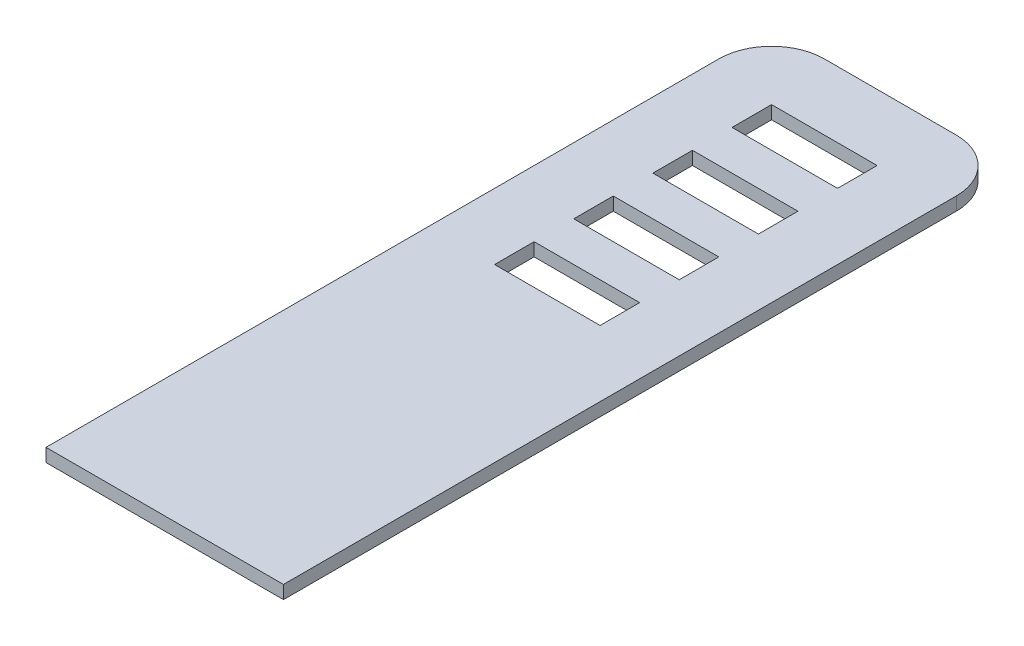
ISO-10303-21;
HEADER;
FILE_DESCRIPTION(('STEP AP214'),'2;1');
FILE_NAME('part.step','',(''),(''),'','','');
FILE_SCHEMA(('AUTOMOTIVE_DESIGN { 1 0 10303 214 1 1 1 1 }'));
ENDSEC;
DATA;
#1=APPLICATION_CONTEXT('core data for automotive mechanical design processes');
#2=APPLICATION_PROTOCOL_DEFINITION('international standard','automotive_design',2000,#1);
#3=PRODUCT_CONTEXT('',#1,'mechanical');
#4=PRODUCT('Part','Part','',(#3));
#5=PRODUCT_RELATED_PRODUCT_CATEGORY('part','',(#4));
#6=PRODUCT_DEFINITION_FORMATION('','',#4);
#7=PRODUCT_DEFINITION_CONTEXT('part definition',#1,'design');
#8=PRODUCT_DEFINITION('design','',#6,#7);
#9=PRODUCT_DEFINITION_SHAPE('','',#8);
#10=(LENGTH_UNIT() NAMED_UNIT(*) SI_UNIT(.MILLI.,.METRE.));
#11=(NAMED_UNIT(*) PLANE_ANGLE_UNIT() SI_UNIT($,.RADIAN.));
#12=(NAMED_UNIT(*) SI_UNIT($,.STERADIAN.) SOLID_ANGLE_UNIT());
#13=UNCERTAINTY_MEASURE_WITH_UNIT(LENGTH_MEASURE(1.E-05),#10,'distance_accuracy_value','');
#14=(GEOMETRIC_REPRESENTATION_CONTEXT(3) GLOBAL_UNCERTAINTY_ASSIGNED_CONTEXT((#13)) GLOBAL_UNIT_ASSIGNED_CONTEXT((#10,
#11,#12)) REPRESENTATION_CONTEXT('',''));
#15=CARTESIAN_POINT('',(0.,0.,0.));
#16=DIRECTION('',(0.,0.,1.));
#17=DIRECTION('',(1.,0.,0.));
#18=AXIS2_PLACEMENT_3D('',#15,#16,#17);
#19=CARTESIAN_POINT('',(0.,0.,0.));
#20=DIRECTION('',(0.,1.,0.));
#21=DIRECTION('',(0.,0.,1.));
#22=AXIS2_PLACEMENT_3D('',#19,#20,#21);
#23=PLANE('',#22);
#24=DIRECTION('',(-1.,0.,0.));
#25=VECTOR('',#24,1.);
#26=CARTESIAN_POINT('',(5.,0.,8.));
#27=LINE('',#26,#25);
#28=CARTESIAN_POINT('',(13.,0.,8.));
#29=VERTEX_POINT('',#28);
#30=CARTESIAN_POINT('',(5.,0.,8.));
#31=VERTEX_POINT('',#30);
#32=EDGE_CURVE('E265',#29,#31,#27,.T.);
#33=ORIENTED_EDGE('',*,*,#32,.F.);
#34=DIRECTION('',(0.,0.,1.));
#35=VECTOR('',#34,1.);
#36=CARTESIAN_POINT('',(13.,0.,8.));
#37=LINE('',#36,#35);
#38=CARTESIAN_POINT('',(13.,0.,5.));
#39=VERTEX_POINT('',#38);
#40=EDGE_CURVE('E238',#39,#29,#37,.T.);
#41=ORIENTED_EDGE('',*,*,#40,.F.);
#42=DIRECTION('',(1.,0.,0.));
#43=VECTOR('',#42,1.);
#44=CARTESIAN_POINT('',(5.,0.,5.));
#45=LINE('',#44,#43);
#46=CARTESIAN_POINT('',(5.,0.,5.));
#47=VERTEX_POINT('',#46);
#48=EDGE_CURVE('E256',#47,#39,#45,.T.);
#49=ORIENTED_EDGE('',*,*,#48,.F.);
#50=DIRECTION('',(0.,0.,-1.));
#51=VECTOR('',#50,1.);
#52=CARTESIAN_POINT('',(5.,0.,8.));
#53=LINE('',#52,#51);
#54=EDGE_CURVE('E259',#31,#47,#53,.T.);
#55=ORIENTED_EDGE('',*,*,#54,.F.);
#56=EDGE_LOOP('',(#33,#41,#49,#55));
#57=FACE_BOUND('',#56,.T.);
#58=DIRECTION('',(-1.,0.,0.));
#59=VECTOR('',#58,1.);
#60=CARTESIAN_POINT('',(5.,0.,14.));
#61=LINE('',#60,#59);
#62=CARTESIAN_POINT('',(13.,0.,14.));
#63=VERTEX_POINT('',#62);
#64=CARTESIAN_POINT('',(5.,0.,14.));
#65=VERTEX_POINT('',#64);
#66=EDGE_CURVE('E292',#63,#65,#61,.T.);
#67=ORIENTED_EDGE('',*,*,#66,.F.);
#68=DIRECTION('',(0.,0.,1.));
#69=VECTOR('',#68,1.);
#70=CARTESIAN_POINT('',(13.,0.,14.));
#71=LINE('',#70,#69);
#72=CARTESIAN_POINT('',(13.,0.,11.));
#73=VERTEX_POINT('',#72);
#74=EDGE_CURVE('E290',#73,#63,#71,.T.);
#75=ORIENTED_EDGE('',*,*,#74,.F.);
#76=DIRECTION('',(1.,0.,0.));
#77=VECTOR('',#76,1.);
#78=CARTESIAN_POINT('',(5.,0.,11.));
#79=LINE('',#78,#77);
#80=CARTESIAN_POINT('',(5.,0.,11.));
#81=VERTEX_POINT('',#80);
#82=EDGE_CURVE('E280',#81,#73,#79,.T.);
#83=ORIENTED_EDGE('',*,*,#82,.F.);
#84=DIRECTION('',(0.,0.,-1.));
#85=VECTOR('',#84,1.);
#86=CARTESIAN_POINT('',(5.,0.,14.));
#87=LINE('',#86,#85);
#88=EDGE_CURVE('E296',#65,#81,#87,.T.);
#89=ORIENTED_EDGE('',*,*,#88,.F.);
#90=EDGE_LOOP('',(#67,#75,#83,#89));
#91=FACE_BOUND('',#90,.T.);
#92=DIRECTION('',(-1.,0.,0.));
#93=VECTOR('',#92,1.);
#94=CARTESIAN_POINT('',(5.,0.,20.));
#95=LINE('',#94,#93);
#96=CARTESIAN_POINT('',(13.,0.,20.));
#97=VERTEX_POINT('',#96);
#98=CARTESIAN_POINT('',(5.,0.,20.));
#99=VERTEX_POINT('',#98);
#100=EDGE_CURVE('E324',#97,#99,#95,.T.);
#101=ORIENTED_EDGE('',*,*,#100,.F.);
#102=DIRECTION('',(0.,0.,1.));
#103=VECTOR('',#102,1.);
#104=CARTESIAN_POINT('',(13.,0.,20.));
#105=LINE('',#104,#103);
#106=CARTESIAN_POINT('',(13.,0.,17.));
#107=VERTEX_POINT('',#106);
#108=EDGE_CURVE('E322',#107,#97,#105,.T.);
#109=ORIENTED_EDGE('',*,*,#108,.F.);
#110=DIRECTION('',(1.,0.,0.));
#111=VECTOR('',#110,1.);
#112=CARTESIAN_POINT('',(5.,0.,17.));
#113=LINE('',#112,#111);
#114=CARTESIAN_POINT('',(5.,0.,17.));
#115=VERTEX_POINT('',#114);
#116=EDGE_CURVE('E312',#115,#107,#113,.T.);
#117=ORIENTED_EDGE('',*,*,#116,.F.);
#118=DIRECTION('',(0.,0.,-1.));
#119=VECTOR('',#118,1.);
#120=CARTESIAN_POINT('',(5.,0.,20.));
#121=LINE('',#120,#119);
#122=EDGE_CURVE('E328',#99,#115,#121,.T.);
#123=ORIENTED_EDGE('',*,*,#122,.F.);
#124=EDGE_LOOP('',(#101,#109,#117,#123));
#125=FACE_BOUND('',#124,.T.);
#126=DIRECTION('',(-1.,0.,0.));
#127=VECTOR('',#126,1.);
#128=CARTESIAN_POINT('',(5.,0.,26.));
#129=LINE('',#128,#127);
#130=CARTESIAN_POINT('',(13.,0.,26.));
#131=VERTEX_POINT('',#130);
#132=CARTESIAN_POINT('',(5.,0.,26.));
#133=VERTEX_POINT('',#132);
#134=EDGE_CURVE('E356',#131,#133,#129,.T.);
#135=ORIENTED_EDGE('',*,*,#134,.F.);
#136=DIRECTION('',(0.,0.,1.));
#137=VECTOR('',#136,1.);
#138=CARTESIAN_POINT('',(13.,0.,26.));
#139=LINE('',#138,#137);
#140=CARTESIAN_POINT('',(13.,0.,23.));
#141=VERTEX_POINT('',#140);
#142=EDGE_CURVE('E354',#141,#131,#139,.T.);
#143=ORIENTED_EDGE('',*,*,#142,.F.);
#144=DIRECTION('',(1.,0.,0.));
#145=VECTOR('',#144,1.);
#146=CARTESIAN_POINT('',(5.,0.,23.));
#147=LINE('',#146,#145);
#148=CARTESIAN_POINT('',(5.,0.,23.));
#149=VERTEX_POINT('',#148);
#150=EDGE_CURVE('E344',#149,#141,#147,.T.);
#151=ORIENTED_EDGE('',*,*,#150,.F.);
#152=DIRECTION('',(0.,0.,-1.));
#153=VECTOR('',#152,1.);
#154=CARTESIAN_POINT('',(5.,0.,26.));
#155=LINE('',#154,#153);
#156=EDGE_CURVE('E359',#133,#149,#155,.T.);
#157=ORIENTED_EDGE('',*,*,#156,.F.);
#158=EDGE_LOOP('',(#135,#143,#151,#157));
#159=FACE_BOUND('',#158,.T.);
#160=DIRECTION('',(0.,0.,-1.));
#161=VECTOR('',#160,1.);
#162=CARTESIAN_POINT('',(5.20000000000001,0.,50.8));
#163=LINE('',#162,#161);
#164=CARTESIAN_POINT('',(5.20000000000001,0.,50.8));
#165=VERTEX_POINT('',#164);
#166=CARTESIAN_POINT('',(5.20000000000001,0.,47.2));
#167=VERTEX_POINT('',#166);
#168=EDGE_CURVE('E403',#165,#167,#163,.T.);
#169=ORIENTED_EDGE('',*,*,#168,.F.);
#170=DIRECTION('',(-1.,0.,0.));
#171=VECTOR('',#170,1.);
#172=CARTESIAN_POINT('',(5.20000000000001,0.,50.8));
#173=LINE('',#172,#171);
#174=CARTESIAN_POINT('',(12.8,0.,50.8));
#175=VERTEX_POINT('',#174);
#176=EDGE_CURVE('E408',#175,#165,#173,.T.);
#177=ORIENTED_EDGE('',*,*,#176,.F.);
#178=DIRECTION('',(0.,0.,1.));
#179=VECTOR('',#178,1.);
#180=CARTESIAN_POINT('',(12.8,0.,50.8));
#181=LINE('',#180,#179);
#182=CARTESIAN_POINT('',(12.8,0.,47.2));
#183=VERTEX_POINT('',#182);
#184=EDGE_CURVE('E420',#183,#175,#181,.T.);
#185=ORIENTED_EDGE('',*,*,#184,.F.);
#186=DIRECTION('',(1.,0.,0.));
#187=VECTOR('',#186,1.);
#188=CARTESIAN_POINT('',(5.20000000000001,0.,47.2));
#189=LINE('',#188,#187);
#190=EDGE_CURVE('E417',#167,#183,#189,.T.);
#191=ORIENTED_EDGE('',*,*,#190,.F.);
#192=EDGE_LOOP('',(#169,#177,#185,#191));
#193=FACE_BOUND('',#192,.T.);
#194=DIRECTION('',(0.,0.,1.));
#195=VECTOR('',#194,1.);
#196=CARTESIAN_POINT('',(0.,0.,0.));
#197=LINE('',#196,#195);
#198=CARTESIAN_POINT('',(0.,0.,4.));
#199=VERTEX_POINT('',#198);
#200=CARTESIAN_POINT('',(0.,0.,55.));
#201=VERTEX_POINT('',#200);
#202=EDGE_CURVE('E450',#199,#201,#197,.T.);
#203=ORIENTED_EDGE('',*,*,#202,.F.);
#204=CARTESIAN_POINT('',(4.,0.,4.));
#205=DIRECTION('',(0.,1.,0.));
#206=DIRECTION('',(0.,0.,1.));
#207=AXIS2_PLACEMENT_3D('',#204,#205,#206);
#208=CIRCLE('',#207,4.);
#209=CARTESIAN_POINT('',(4.,0.,0.));
#210=VERTEX_POINT('',#209);
#211=EDGE_CURVE('E463',#199,#210,#208,.F.);
#212=ORIENTED_EDGE('',*,*,#211,.T.);
#213=DIRECTION('',(-1.,0.,0.));
#214=VECTOR('',#213,1.);
#215=CARTESIAN_POINT('',(18.,0.,0.));
#216=LINE('',#215,#214);
#217=CARTESIAN_POINT('',(14.,0.,0.));
#218=VERTEX_POINT('',#217);
#219=EDGE_CURVE('E448',#218,#210,#216,.T.);
#220=ORIENTED_EDGE('',*,*,#219,.F.);
#221=CARTESIAN_POINT('',(14.,0.,4.));
#222=DIRECTION('',(0.,1.,0.));
#223=DIRECTION('',(0.,0.,1.));
#224=AXIS2_PLACEMENT_3D('',#221,#222,#223);
#225=CIRCLE('',#224,4.);
#226=CARTESIAN_POINT('',(18.,0.,4.));
#227=VERTEX_POINT('',#226);
#228=EDGE_CURVE('E461',#218,#227,#225,.F.);
#229=ORIENTED_EDGE('',*,*,#228,.T.);
#230=DIRECTION('',(0.,0.,-1.));
#231=VECTOR('',#230,1.);
#232=CARTESIAN_POINT('',(18.,0.,0.));
#233=LINE('',#232,#231);
#234=CARTESIAN_POINT('',(18.,0.,55.));
#235=VERTEX_POINT('',#234);
#236=EDGE_CURVE('E436',#235,#227,#233,.T.);
#237=ORIENTED_EDGE('',*,*,#236,.F.);
#238=DIRECTION('',(1.,0.,0.));
#239=VECTOR('',#238,1.);
#240=CARTESIAN_POINT('',(0.,0.,55.));
#241=LINE('',#240,#239);
#242=EDGE_CURVE('E440',#201,#235,#241,.T.);
#243=ORIENTED_EDGE('',*,*,#242,.F.);
#244=EDGE_LOOP('',(#203,#212,#220,#229,#237,#243));
#245=FACE_BOUND('',#244,.T.);
#246=DIRECTION('',(-1.,0.,0.));
#247=VECTOR('',#246,1.);
#248=CARTESIAN_POINT('',(5.20000000000001,0.,41.4));
#249=LINE('',#248,#247);
#250=CARTESIAN_POINT('',(12.8,0.,41.4));
#251=VERTEX_POINT('',#250);
#252=CARTESIAN_POINT('',(5.20000000000001,0.,41.4));
#253=VERTEX_POINT('',#252);
#254=EDGE_CURVE('E272',#251,#253,#249,.T.);
#255=ORIENTED_EDGE('',*,*,#254,.F.);
#256=DIRECTION('',(0.,0.,1.));
#257=VECTOR('',#256,1.);
#258=CARTESIAN_POINT('',(12.8,0.,41.4));
#259=LINE('',#258,#257);
#260=CARTESIAN_POINT('',(12.8,0.,37.8));
#261=VERTEX_POINT('',#260);
#262=EDGE_CURVE('E375',#261,#251,#259,.T.);
#263=ORIENTED_EDGE('',*,*,#262,.F.);
#264=DIRECTION('',(1.,0.,0.));
#265=VECTOR('',#264,1.);
#266=CARTESIAN_POINT('',(5.20000000000001,0.,37.8));
#267=LINE('',#266,#265);
#268=CARTESIAN_POINT('',(5.20000000000001,0.,37.8));
#269=VERTEX_POINT('',#268);
#270=EDGE_CURVE('E387',#269,#261,#267,.T.);
#271=ORIENTED_EDGE('',*,*,#270,.F.);
#272=DIRECTION('',(0.,0.,-1.));
#273=VECTOR('',#272,1.);
#274=CARTESIAN_POINT('',(5.20000000000001,0.,41.4));
#275=LINE('',#274,#273);
#276=EDGE_CURVE('E384',#253,#269,#275,.T.);
#277=ORIENTED_EDGE('',*,*,#276,.F.);
#278=EDGE_LOOP('',(#255,#263,#271,#277));
#279=FACE_BOUND('',#278,.T.);
#280=ADVANCED_FACE('F32',(#57,#91,#125,#159,#193,#245,#279),#23,.F.);
#281=CARTESIAN_POINT('',(18.,1.,0.));
#282=DIRECTION('',(-1.,0.,0.));
#283=DIRECTION('',(0.,0.,1.));
#284=AXIS2_PLACEMENT_3D('',#281,#282,#283);
#285=PLANE('',#284);
#286=ORIENTED_EDGE('',*,*,#236,.T.);
#287=DIRECTION('',(0.,-1.,0.));
#288=VECTOR('',#287,1.);
#289=CARTESIAN_POINT('',(18.,1.,4.));
#290=LINE('',#289,#288);
#291=CARTESIAN_POINT('',(18.,1.,4.));
#292=VERTEX_POINT('',#291);
#293=EDGE_CURVE('E11',#227,#292,#290,.F.);
#294=ORIENTED_EDGE('',*,*,#293,.T.);
#295=DIRECTION('',(0.,0.,-1.));
#296=VECTOR('',#295,1.);
#297=CARTESIAN_POINT('',(18.,1.,0.));
#298=LINE('',#297,#296);
#299=CARTESIAN_POINT('',(18.,1.,55.));
#300=VERTEX_POINT('',#299);
#301=EDGE_CURVE('E437',#300,#292,#298,.T.);
#302=ORIENTED_EDGE('',*,*,#301,.F.);
#303=DIRECTION('',(0.,-1.,0.));
#304=VECTOR('',#303,1.);
#305=CARTESIAN_POINT('',(18.,1.,55.));
#306=LINE('',#305,#304);
#307=EDGE_CURVE('E446',#300,#235,#306,.T.);
#308=ORIENTED_EDGE('',*,*,#307,.T.);
#309=EDGE_LOOP('',(#286,#294,#302,#308));
#310=FACE_BOUND('',#309,.T.);
#311=ADVANCED_FACE('F490',(#310),#285,.F.);
#312=CARTESIAN_POINT('',(18.,1.,0.));
#313=DIRECTION('',(0.,0.,1.));
#314=DIRECTION('',(1.,0.,0.));
#315=AXIS2_PLACEMENT_3D('',#312,#313,#314);
#316=PLANE('',#315);
#317=ORIENTED_EDGE('',*,*,#219,.T.);
#318=DIRECTION('',(0.,-1.,0.));
#319=VECTOR('',#318,1.);
#320=CARTESIAN_POINT('',(4.,1.,0.));
#321=LINE('',#320,#319);
#322=CARTESIAN_POINT('',(4.,1.,0.));
#323=VERTEX_POINT('',#322);
#324=EDGE_CURVE('E53',#210,#323,#321,.F.);
#325=ORIENTED_EDGE('',*,*,#324,.T.);
#326=DIRECTION('',(-1.,0.,0.));
#327=VECTOR('',#326,1.);
#328=CARTESIAN_POINT('',(18.,1.,0.));
#329=LINE('',#328,#327);
#330=CARTESIAN_POINT('',(14.,1.,0.));
#331=VERTEX_POINT('',#330);
#332=EDGE_CURVE('E439',#331,#323,#329,.T.);
#333=ORIENTED_EDGE('',*,*,#332,.F.);
#334=DIRECTION('',(0.,-1.,0.));
#335=VECTOR('',#334,1.);
#336=CARTESIAN_POINT('',(14.,1.,0.));
#337=LINE('',#336,#335);
#338=EDGE_CURVE('E465',#331,#218,#337,.T.);
#339=ORIENTED_EDGE('',*,*,#338,.T.);
#340=EDGE_LOOP('',(#317,#325,#333,#339));
#341=FACE_BOUND('',#340,.T.);
#342=ADVANCED_FACE('F485',(#341),#316,.F.);
#343=CARTESIAN_POINT('',(0.,1.,0.));
#344=DIRECTION('',(1.,0.,0.));
#345=DIRECTION('',(0.,0.,-1.));
#346=AXIS2_PLACEMENT_3D('',#343,#344,#345);
#347=PLANE('',#346);
#348=DIRECTION('',(0.,0.,1.));
#349=VECTOR('',#348,1.);
#350=CARTESIAN_POINT('',(0.,1.,0.));
#351=LINE('',#350,#349);
#352=CARTESIAN_POINT('',(0.,1.,4.));
#353=VERTEX_POINT('',#352);
#354=CARTESIAN_POINT('',(0.,1.,55.));
#355=VERTEX_POINT('',#354);
#356=EDGE_CURVE('E442',#353,#355,#351,.T.);
#357=ORIENTED_EDGE('',*,*,#356,.F.);
#358=DIRECTION('',(0.,-1.,0.));
#359=VECTOR('',#358,1.);
#360=CARTESIAN_POINT('',(0.,1.,4.));
#361=LINE('',#360,#359);
#362=EDGE_CURVE('E458',#353,#199,#361,.T.);
#363=ORIENTED_EDGE('',*,*,#362,.T.);
#364=ORIENTED_EDGE('',*,*,#202,.T.);
#365=DIRECTION('',(0.,-1.,0.));
#366=VECTOR('',#365,1.);
#367=CARTESIAN_POINT('',(0.,1.,55.));
#368=LINE('',#367,#366);
#369=EDGE_CURVE('E455',#355,#201,#368,.T.);
#370=ORIENTED_EDGE('',*,*,#369,.F.);
#371=EDGE_LOOP('',(#357,#363,#364,#370));
#372=FACE_BOUND('',#371,.T.);
#373=ADVANCED_FACE('F477',(#372),#347,.F.);
#374=CARTESIAN_POINT('',(0.,1.,55.));
#375=DIRECTION('',(0.,0.,-1.));
#376=DIRECTION('',(-1.,0.,0.));
#377=AXIS2_PLACEMENT_3D('',#374,#375,#376);
#378=PLANE('',#377);
#379=ORIENTED_EDGE('',*,*,#242,.T.);
#380=ORIENTED_EDGE('',*,*,#307,.F.);
#381=DIRECTION('',(1.,0.,0.));
#382=VECTOR('',#381,1.);
#383=CARTESIAN_POINT('',(0.,1.,55.));
#384=LINE('',#383,#382);
#385=EDGE_CURVE('E444',#355,#300,#384,.T.);
#386=ORIENTED_EDGE('',*,*,#385,.F.);
#387=ORIENTED_EDGE('',*,*,#369,.T.);
#388=EDGE_LOOP('',(#379,#380,#386,#387));
#389=FACE_BOUND('',#388,.T.);
#390=ADVANCED_FACE('F493',(#389),#378,.F.);
#391=CARTESIAN_POINT('',(0.,1.,0.));
#392=DIRECTION('',(0.,1.,0.));
#393=DIRECTION('',(0.,0.,1.));
#394=AXIS2_PLACEMENT_3D('',#391,#392,#393);
#395=PLANE('',#394);
#396=DIRECTION('',(0.,0.,1.));
#397=VECTOR('',#396,1.);
#398=CARTESIAN_POINT('',(13.,1.,8.));
#399=LINE('',#398,#397);
#400=CARTESIAN_POINT('',(13.,1.,5.));
#401=VERTEX_POINT('',#400);
#402=CARTESIAN_POINT('',(13.,1.,8.));
#403=VERTEX_POINT('',#402);
#404=EDGE_CURVE('E235',#401,#403,#399,.T.);
#405=ORIENTED_EDGE('',*,*,#404,.T.);
#406=DIRECTION('',(-1.,0.,0.));
#407=VECTOR('',#406,1.);
#408=CARTESIAN_POINT('',(5.,1.,8.));
#409=LINE('',#408,#407);
#410=CARTESIAN_POINT('',(5.,1.,8.));
#411=VERTEX_POINT('',#410);
#412=EDGE_CURVE('E247',#403,#411,#409,.T.);
#413=ORIENTED_EDGE('',*,*,#412,.T.);
#414=DIRECTION('',(0.,0.,-1.));
#415=VECTOR('',#414,1.);
#416=CARTESIAN_POINT('',(5.,1.,8.));
#417=LINE('',#416,#415);
#418=CARTESIAN_POINT('',(5.,1.,5.));
#419=VERTEX_POINT('',#418);
#420=EDGE_CURVE('E251',#411,#419,#417,.T.);
#421=ORIENTED_EDGE('',*,*,#420,.T.);
#422=DIRECTION('',(1.,0.,0.));
#423=VECTOR('',#422,1.);
#424=CARTESIAN_POINT('',(5.,1.,5.));
#425=LINE('',#424,#423);
#426=EDGE_CURVE('E243',#419,#401,#425,.T.);
#427=ORIENTED_EDGE('',*,*,#426,.T.);
#428=EDGE_LOOP('',(#405,#413,#421,#427));
#429=FACE_BOUND('',#428,.T.);
#430=DIRECTION('',(0.,0.,1.));
#431=VECTOR('',#430,1.);
#432=CARTESIAN_POINT('',(13.,1.,14.));
#433=LINE('',#432,#431);
#434=CARTESIAN_POINT('',(13.,1.,11.));
#435=VERTEX_POINT('',#434);
#436=CARTESIAN_POINT('',(13.,1.,14.));
#437=VERTEX_POINT('',#436);
#438=EDGE_CURVE('E276',#435,#437,#433,.T.);
#439=ORIENTED_EDGE('',*,*,#438,.T.);
#440=DIRECTION('',(-1.,0.,0.));
#441=VECTOR('',#440,1.);
#442=CARTESIAN_POINT('',(5.,1.,14.));
#443=LINE('',#442,#441);
#444=CARTESIAN_POINT('',(5.,1.,14.));
#445=VERTEX_POINT('',#444);
#446=EDGE_CURVE('E279',#437,#445,#443,.T.);
#447=ORIENTED_EDGE('',*,*,#446,.T.);
#448=DIRECTION('',(0.,0.,-1.));
#449=VECTOR('',#448,1.);
#450=CARTESIAN_POINT('',(5.,1.,14.));
#451=LINE('',#450,#449);
#452=CARTESIAN_POINT('',(5.,1.,11.));
#453=VERTEX_POINT('',#452);
#454=EDGE_CURVE('E283',#445,#453,#451,.T.);
#455=ORIENTED_EDGE('',*,*,#454,.T.);
#456=DIRECTION('',(1.,0.,0.));
#457=VECTOR('',#456,1.);
#458=CARTESIAN_POINT('',(5.,1.,11.));
#459=LINE('',#458,#457);
#460=EDGE_CURVE('E286',#453,#435,#459,.T.);
#461=ORIENTED_EDGE('',*,*,#460,.T.);
#462=EDGE_LOOP('',(#439,#447,#455,#461));
#463=FACE_BOUND('',#462,.T.);
#464=DIRECTION('',(0.,0.,1.));
#465=VECTOR('',#464,1.);
#466=CARTESIAN_POINT('',(13.,1.,20.));
#467=LINE('',#466,#465);
#468=CARTESIAN_POINT('',(13.,1.,17.));
#469=VERTEX_POINT('',#468);
#470=CARTESIAN_POINT('',(13.,1.,20.));
#471=VERTEX_POINT('',#470);
#472=EDGE_CURVE('E308',#469,#471,#467,.T.);
#473=ORIENTED_EDGE('',*,*,#472,.T.);
#474=DIRECTION('',(-1.,0.,0.));
#475=VECTOR('',#474,1.);
#476=CARTESIAN_POINT('',(5.,1.,20.));
#477=LINE('',#476,#475);
#478=CARTESIAN_POINT('',(5.,1.,20.));
#479=VERTEX_POINT('',#478);
#480=EDGE_CURVE('E311',#471,#479,#477,.T.);
#481=ORIENTED_EDGE('',*,*,#480,.T.);
#482=DIRECTION('',(0.,0.,-1.));
#483=VECTOR('',#482,1.);
#484=CARTESIAN_POINT('',(5.,1.,20.));
#485=LINE('',#484,#483);
#486=CARTESIAN_POINT('',(5.,1.,17.));
#487=VERTEX_POINT('',#486);
#488=EDGE_CURVE('E315',#479,#487,#485,.T.);
#489=ORIENTED_EDGE('',*,*,#488,.T.);
#490=DIRECTION('',(1.,0.,0.));
#491=VECTOR('',#490,1.);
#492=CARTESIAN_POINT('',(5.,1.,17.));
#493=LINE('',#492,#491);
#494=EDGE_CURVE('E318',#487,#469,#493,.T.);
#495=ORIENTED_EDGE('',*,*,#494,.T.);
#496=EDGE_LOOP('',(#473,#481,#489,#495));
#497=FACE_BOUND('',#496,.T.);
#498=DIRECTION('',(0.,0.,1.));
#499=VECTOR('',#498,1.);
#500=CARTESIAN_POINT('',(13.,1.,26.));
#501=LINE('',#500,#499);
#502=CARTESIAN_POINT('',(13.,1.,23.));
#503=VERTEX_POINT('',#502);
#504=CARTESIAN_POINT('',(13.,1.,26.));
#505=VERTEX_POINT('',#504);
#506=EDGE_CURVE('E340',#503,#505,#501,.T.);
#507=ORIENTED_EDGE('',*,*,#506,.T.);
#508=DIRECTION('',(-1.,0.,0.));
#509=VECTOR('',#508,1.);
#510=CARTESIAN_POINT('',(5.,1.,26.));
#511=LINE('',#510,#509);
#512=CARTESIAN_POINT('',(5.,1.,26.));
#513=VERTEX_POINT('',#512);
#514=EDGE_CURVE('E343',#505,#513,#511,.T.);
#515=ORIENTED_EDGE('',*,*,#514,.T.);
#516=DIRECTION('',(0.,0.,-1.));
#517=VECTOR('',#516,1.);
#518=CARTESIAN_POINT('',(5.,1.,26.));
#519=LINE('',#518,#517);
#520=CARTESIAN_POINT('',(5.,1.,23.));
#521=VERTEX_POINT('',#520);
#522=EDGE_CURVE('E347',#513,#521,#519,.T.);
#523=ORIENTED_EDGE('',*,*,#522,.T.);
#524=DIRECTION('',(1.,0.,0.));
#525=VECTOR('',#524,1.);
#526=CARTESIAN_POINT('',(5.,1.,23.));
#527=LINE('',#526,#525);
#528=EDGE_CURVE('E350',#521,#503,#527,.T.);
#529=ORIENTED_EDGE('',*,*,#528,.T.);
#530=EDGE_LOOP('',(#507,#515,#523,#529));
#531=FACE_BOUND('',#530,.T.);
#532=ORIENTED_EDGE('',*,*,#332,.T.);
#533=CARTESIAN_POINT('',(4.,1.,4.));
#534=DIRECTION('',(0.,1.,0.));
#535=DIRECTION('',(0.,0.,1.));
#536=AXIS2_PLACEMENT_3D('',#533,#534,#535);
#537=CIRCLE('',#536,4.);
#538=EDGE_CURVE('E40',#323,#353,#537,.T.);
#539=ORIENTED_EDGE('',*,*,#538,.T.);
#540=ORIENTED_EDGE('',*,*,#356,.T.);
#541=ORIENTED_EDGE('',*,*,#385,.T.);
#542=ORIENTED_EDGE('',*,*,#301,.T.);
#543=CARTESIAN_POINT('',(14.,1.,4.));
#544=DIRECTION('',(0.,1.,0.));
#545=DIRECTION('',(0.,0.,1.));
#546=AXIS2_PLACEMENT_3D('',#543,#544,#545);
#547=CIRCLE('',#546,4.);
#548=EDGE_CURVE('E469',#292,#331,#547,.T.);
#549=ORIENTED_EDGE('',*,*,#548,.T.);
#550=EDGE_LOOP('',(#532,#539,#540,#541,#542,#549));
#551=FACE_BOUND('',#550,.T.);
#552=ADVANCED_FACE('F253',(#429,#463,#497,#531,#551),#395,.T.);
#553=CARTESIAN_POINT('',(5.20000000000001,-1.,50.8));
#554=DIRECTION('',(1.,0.,0.));
#555=DIRECTION('',(0.,0.,-1.));
#556=AXIS2_PLACEMENT_3D('',#553,#554,#555);
#557=PLANE('',#556);
#558=ORIENTED_EDGE('',*,*,#168,.T.);
#559=DIRECTION('',(0.,1.,0.));
#560=VECTOR('',#559,1.);
#561=CARTESIAN_POINT('',(5.20000000000001,-1.,47.2));
#562=LINE('',#561,#560);
#563=CARTESIAN_POINT('',(5.20000000000001,-1.,47.2));
#564=VERTEX_POINT('',#563);
#565=EDGE_CURVE('E433',#564,#167,#562,.T.);
#566=ORIENTED_EDGE('',*,*,#565,.F.);
#567=DIRECTION('',(0.,0.,-1.));
#568=VECTOR('',#567,1.);
#569=CARTESIAN_POINT('',(5.20000000000001,-1.,50.8));
#570=LINE('',#569,#568);
#571=CARTESIAN_POINT('',(5.20000000000001,-1.,50.8));
#572=VERTEX_POINT('',#571);
#573=EDGE_CURVE('E404',#572,#564,#570,.T.);
#574=ORIENTED_EDGE('',*,*,#573,.F.);
#575=DIRECTION('',(0.,1.,0.));
#576=VECTOR('',#575,1.);
#577=CARTESIAN_POINT('',(5.20000000000001,-1.,50.8));
#578=LINE('',#577,#576);
#579=EDGE_CURVE('E414',#572,#165,#578,.T.);
#580=ORIENTED_EDGE('',*,*,#579,.T.);
#581=EDGE_LOOP('',(#558,#566,#574,#580));
#582=FACE_BOUND('',#581,.T.);
#583=ADVANCED_FACE('F501',(#582),#557,.F.);
#584=CARTESIAN_POINT('',(5.20000000000001,-1.,47.2));
#585=DIRECTION('',(0.,0.,1.));
#586=DIRECTION('',(1.,0.,0.));
#587=AXIS2_PLACEMENT_3D('',#584,#585,#586);
#588=PLANE('',#587);
#589=ORIENTED_EDGE('',*,*,#190,.T.);
#590=DIRECTION('',(0.,1.,0.));
#591=VECTOR('',#590,1.);
#592=CARTESIAN_POINT('',(12.8,-1.,47.2));
#593=LINE('',#592,#591);
#594=CARTESIAN_POINT('',(12.8,-1.,47.2));
#595=VERTEX_POINT('',#594);
#596=EDGE_CURVE('E430',#595,#183,#593,.T.);
#597=ORIENTED_EDGE('',*,*,#596,.F.);
#598=DIRECTION('',(1.,0.,0.));
#599=VECTOR('',#598,1.);
#600=CARTESIAN_POINT('',(5.20000000000001,-1.,47.2));
#601=LINE('',#600,#599);
#602=EDGE_CURVE('E407',#564,#595,#601,.T.);
#603=ORIENTED_EDGE('',*,*,#602,.F.);
#604=ORIENTED_EDGE('',*,*,#565,.T.);
#605=EDGE_LOOP('',(#589,#597,#603,#604));
#606=FACE_BOUND('',#605,.T.);
#607=ADVANCED_FACE('F517',(#606),#588,.F.);
#608=CARTESIAN_POINT('',(12.8,-1.,50.8));
#609=DIRECTION('',(-1.,0.,0.));
#610=DIRECTION('',(0.,0.,1.));
#611=AXIS2_PLACEMENT_3D('',#608,#609,#610);
#612=PLANE('',#611);
#613=ORIENTED_EDGE('',*,*,#184,.T.);
#614=DIRECTION('',(0.,1.,0.));
#615=VECTOR('',#614,1.);
#616=CARTESIAN_POINT('',(12.8,-1.,50.8));
#617=LINE('',#616,#615);
#618=CARTESIAN_POINT('',(12.8,-1.,50.8));
#619=VERTEX_POINT('',#618);
#620=EDGE_CURVE('E427',#619,#175,#617,.T.);
#621=ORIENTED_EDGE('',*,*,#620,.F.);
#622=DIRECTION('',(0.,0.,1.));
#623=VECTOR('',#622,1.);
#624=CARTESIAN_POINT('',(12.8,-1.,50.8));
#625=LINE('',#624,#623);
#626=EDGE_CURVE('E410',#595,#619,#625,.T.);
#627=ORIENTED_EDGE('',*,*,#626,.F.);
#628=ORIENTED_EDGE('',*,*,#596,.T.);
#629=EDGE_LOOP('',(#613,#621,#627,#628));
#630=FACE_BOUND('',#629,.T.);
#631=ADVANCED_FACE('F521',(#630),#612,.F.);
#632=CARTESIAN_POINT('',(5.20000000000001,-1.,50.8));
#633=DIRECTION('',(0.,0.,-1.));
#634=DIRECTION('',(-1.,0.,0.));
#635=AXIS2_PLACEMENT_3D('',#632,#633,#634);
#636=PLANE('',#635);
#637=ORIENTED_EDGE('',*,*,#176,.T.);
#638=ORIENTED_EDGE('',*,*,#579,.F.);
#639=DIRECTION('',(-1.,0.,0.));
#640=VECTOR('',#639,1.);
#641=CARTESIAN_POINT('',(5.20000000000001,-1.,50.8));
#642=LINE('',#641,#640);
#643=EDGE_CURVE('E412',#619,#572,#642,.T.);
#644=ORIENTED_EDGE('',*,*,#643,.F.);
#645=ORIENTED_EDGE('',*,*,#620,.T.);
#646=EDGE_LOOP('',(#637,#638,#644,#645));
#647=FACE_BOUND('',#646,.T.);
#648=ADVANCED_FACE('F525',(#647),#636,.F.);
#649=CARTESIAN_POINT('',(0.,-1.,0.));
#650=DIRECTION('',(0.,-1.,0.));
#651=DIRECTION('',(0.,0.,-1.));
#652=AXIS2_PLACEMENT_3D('',#649,#650,#651);
#653=PLANE('',#652);
#654=ORIENTED_EDGE('',*,*,#573,.T.);
#655=ORIENTED_EDGE('',*,*,#602,.T.);
#656=ORIENTED_EDGE('',*,*,#626,.T.);
#657=ORIENTED_EDGE('',*,*,#643,.T.);
#658=EDGE_LOOP('',(#654,#655,#656,#657));
#659=FACE_BOUND('',#658,.T.);
#660=ADVANCED_FACE('F529',(#659),#653,.T.);
#661=CARTESIAN_POINT('',(5.20000000000001,-1.,41.4));
#662=DIRECTION('',(0.,0.,-1.));
#663=DIRECTION('',(-1.,0.,0.));
#664=AXIS2_PLACEMENT_3D('',#661,#662,#663);
#665=PLANE('',#664);
#666=ORIENTED_EDGE('',*,*,#254,.T.);
#667=DIRECTION('',(0.,1.,0.));
#668=VECTOR('',#667,1.);
#669=CARTESIAN_POINT('',(5.20000000000001,-1.,41.4));
#670=LINE('',#669,#668);
#671=CARTESIAN_POINT('',(5.20000000000001,-1.,41.4));
#672=VERTEX_POINT('',#671);
#673=EDGE_CURVE('E400',#672,#253,#670,.T.);
#674=ORIENTED_EDGE('',*,*,#673,.F.);
#675=DIRECTION('',(-1.,0.,0.));
#676=VECTOR('',#675,1.);
#677=CARTESIAN_POINT('',(5.20000000000001,-1.,41.4));
#678=LINE('',#677,#676);
#679=CARTESIAN_POINT('',(12.8,-1.,41.4));
#680=VERTEX_POINT('',#679);
#681=EDGE_CURVE('E371',#680,#672,#678,.T.);
#682=ORIENTED_EDGE('',*,*,#681,.F.);
#683=DIRECTION('',(0.,1.,0.));
#684=VECTOR('',#683,1.);
#685=CARTESIAN_POINT('',(12.8,-1.,41.4));
#686=LINE('',#685,#684);
#687=EDGE_CURVE('E381',#680,#251,#686,.T.);
#688=ORIENTED_EDGE('',*,*,#687,.T.);
#689=EDGE_LOOP('',(#666,#674,#682,#688));
#690=FACE_BOUND('',#689,.T.);
#691=ADVANCED_FACE('F533',(#690),#665,.F.);
#692=CARTESIAN_POINT('',(5.20000000000001,-1.,41.4));
#693=DIRECTION('',(1.,0.,0.));
#694=DIRECTION('',(0.,0.,-1.));
#695=AXIS2_PLACEMENT_3D('',#692,#693,#694);
#696=PLANE('',#695);
#697=ORIENTED_EDGE('',*,*,#276,.T.);
#698=DIRECTION('',(0.,1.,0.));
#699=VECTOR('',#698,1.);
#700=CARTESIAN_POINT('',(5.20000000000001,-1.,37.8));
#701=LINE('',#700,#699);
#702=CARTESIAN_POINT('',(5.20000000000001,-1.,37.8));
#703=VERTEX_POINT('',#702);
#704=EDGE_CURVE('E397',#703,#269,#701,.T.);
#705=ORIENTED_EDGE('',*,*,#704,.F.);
#706=DIRECTION('',(0.,0.,-1.));
#707=VECTOR('',#706,1.);
#708=CARTESIAN_POINT('',(5.20000000000001,-1.,41.4));
#709=LINE('',#708,#707);
#710=EDGE_CURVE('E374',#672,#703,#709,.T.);
#711=ORIENTED_EDGE('',*,*,#710,.F.);
#712=ORIENTED_EDGE('',*,*,#673,.T.);
#713=EDGE_LOOP('',(#697,#705,#711,#712));
#714=FACE_BOUND('',#713,.T.);
#715=ADVANCED_FACE('F537',(#714),#696,.F.);
#716=CARTESIAN_POINT('',(5.20000000000001,-1.,37.8));
#717=DIRECTION('',(0.,0.,1.));
#718=DIRECTION('',(1.,0.,0.));
#719=AXIS2_PLACEMENT_3D('',#716,#717,#718);
#720=PLANE('',#719);
#721=ORIENTED_EDGE('',*,*,#270,.T.);
#722=DIRECTION('',(0.,1.,0.));
#723=VECTOR('',#722,1.);
#724=CARTESIAN_POINT('',(12.8,-1.,37.8));
#725=LINE('',#724,#723);
#726=CARTESIAN_POINT('',(12.8,-1.,37.8));
#727=VERTEX_POINT('',#726);
#728=EDGE_CURVE('E394',#727,#261,#725,.T.);
#729=ORIENTED_EDGE('',*,*,#728,.F.);
#730=DIRECTION('',(1.,0.,0.));
#731=VECTOR('',#730,1.);
#732=CARTESIAN_POINT('',(5.20000000000001,-1.,37.8));
#733=LINE('',#732,#731);
#734=EDGE_CURVE('E377',#703,#727,#733,.T.);
#735=ORIENTED_EDGE('',*,*,#734,.F.);
#736=ORIENTED_EDGE('',*,*,#704,.T.);
#737=EDGE_LOOP('',(#721,#729,#735,#736));
#738=FACE_BOUND('',#737,.T.);
#739=ADVANCED_FACE('F541',(#738),#720,.F.);
#740=CARTESIAN_POINT('',(12.8,-1.,41.4));
#741=DIRECTION('',(-1.,0.,0.));
#742=DIRECTION('',(0.,0.,1.));
#743=AXIS2_PLACEMENT_3D('',#740,#741,#742);
#744=PLANE('',#743);
#745=ORIENTED_EDGE('',*,*,#262,.T.);
#746=ORIENTED_EDGE('',*,*,#687,.F.);
#747=DIRECTION('',(0.,0.,1.));
#748=VECTOR('',#747,1.);
#749=CARTESIAN_POINT('',(12.8,-1.,41.4));
#750=LINE('',#749,#748);
#751=EDGE_CURVE('E379',#727,#680,#750,.T.);
#752=ORIENTED_EDGE('',*,*,#751,.F.);
#753=ORIENTED_EDGE('',*,*,#728,.T.);
#754=EDGE_LOOP('',(#745,#746,#752,#753));
#755=FACE_BOUND('',#754,.T.);
#756=ADVANCED_FACE('F545',(#755),#744,.F.);
#757=CARTESIAN_POINT('',(0.,-1.,0.));
#758=DIRECTION('',(0.,1.,0.));
#759=DIRECTION('',(0.,0.,1.));
#760=AXIS2_PLACEMENT_3D('',#757,#758,#759);
#761=PLANE('',#760);
#762=ORIENTED_EDGE('',*,*,#681,.T.);
#763=ORIENTED_EDGE('',*,*,#710,.T.);
#764=ORIENTED_EDGE('',*,*,#734,.T.);
#765=ORIENTED_EDGE('',*,*,#751,.T.);
#766=EDGE_LOOP('',(#762,#763,#764,#765));
#767=FACE_BOUND('',#766,.T.);
#768=ADVANCED_FACE('F549',(#767),#761,.F.);
#769=CARTESIAN_POINT('',(13.,1.,26.));
#770=DIRECTION('',(1.,0.,0.));
#771=DIRECTION('',(0.,0.,-1.));
#772=AXIS2_PLACEMENT_3D('',#769,#770,#771);
#773=PLANE('',#772);
#774=ORIENTED_EDGE('',*,*,#142,.T.);
#775=DIRECTION('',(0.,-1.,0.));
#776=VECTOR('',#775,1.);
#777=CARTESIAN_POINT('',(13.,1.,26.));
#778=LINE('',#777,#776);
#779=EDGE_CURVE('E353',#505,#131,#778,.T.);
#780=ORIENTED_EDGE('',*,*,#779,.F.);
#781=ORIENTED_EDGE('',*,*,#506,.F.);
#782=DIRECTION('',(0.,-1.,0.));
#783=VECTOR('',#782,1.);
#784=CARTESIAN_POINT('',(13.,1.,23.));
#785=LINE('',#784,#783);
#786=EDGE_CURVE('E325',#503,#141,#785,.T.);
#787=ORIENTED_EDGE('',*,*,#786,.T.);
#788=EDGE_LOOP('',(#774,#780,#781,#787));
#789=FACE_BOUND('',#788,.T.);
#790=ADVANCED_FACE('F553',(#789),#773,.F.);
#791=CARTESIAN_POINT('',(5.,1.,23.));
#792=DIRECTION('',(0.,0.,-1.));
#793=DIRECTION('',(-1.,0.,0.));
#794=AXIS2_PLACEMENT_3D('',#791,#792,#793);
#795=PLANE('',#794);
#796=ORIENTED_EDGE('',*,*,#150,.T.);
#797=ORIENTED_EDGE('',*,*,#786,.F.);
#798=ORIENTED_EDGE('',*,*,#528,.F.);
#799=DIRECTION('',(0.,-1.,0.));
#800=VECTOR('',#799,1.);
#801=CARTESIAN_POINT('',(5.,1.,23.));
#802=LINE('',#801,#800);
#803=EDGE_CURVE('E365',#521,#149,#802,.T.);
#804=ORIENTED_EDGE('',*,*,#803,.T.);
#805=EDGE_LOOP('',(#796,#797,#798,#804));
#806=FACE_BOUND('',#805,.T.);
#807=ADVANCED_FACE('F557',(#806),#795,.F.);
#808=CARTESIAN_POINT('',(5.,1.,26.));
#809=DIRECTION('',(-1.,0.,0.));
#810=DIRECTION('',(0.,0.,1.));
#811=AXIS2_PLACEMENT_3D('',#808,#809,#810);
#812=PLANE('',#811);
#813=ORIENTED_EDGE('',*,*,#156,.T.);
#814=ORIENTED_EDGE('',*,*,#803,.F.);
#815=ORIENTED_EDGE('',*,*,#522,.F.);
#816=DIRECTION('',(0.,-1.,0.));
#817=VECTOR('',#816,1.);
#818=CARTESIAN_POINT('',(5.,1.,26.));
#819=LINE('',#818,#817);
#820=EDGE_CURVE('E367',#513,#133,#819,.T.);
#821=ORIENTED_EDGE('',*,*,#820,.T.);
#822=EDGE_LOOP('',(#813,#814,#815,#821));
#823=FACE_BOUND('',#822,.T.);
#824=ADVANCED_FACE('F563',(#823),#812,.F.);
#825=CARTESIAN_POINT('',(5.,1.,26.));
#826=DIRECTION('',(0.,0.,1.));
#827=DIRECTION('',(1.,0.,0.));
#828=AXIS2_PLACEMENT_3D('',#825,#826,#827);
#829=PLANE('',#828);
#830=ORIENTED_EDGE('',*,*,#134,.T.);
#831=ORIENTED_EDGE('',*,*,#820,.F.);
#832=ORIENTED_EDGE('',*,*,#514,.F.);
#833=ORIENTED_EDGE('',*,*,#779,.T.);
#834=EDGE_LOOP('',(#830,#831,#832,#833));
#835=FACE_BOUND('',#834,.T.);
#836=ADVANCED_FACE('F559',(#835),#829,.F.);
#837=CARTESIAN_POINT('',(13.,1.,20.));
#838=DIRECTION('',(1.,0.,0.));
#839=DIRECTION('',(0.,0.,-1.));
#840=AXIS2_PLACEMENT_3D('',#837,#838,#839);
#841=PLANE('',#840);
#842=ORIENTED_EDGE('',*,*,#108,.T.);
#843=DIRECTION('',(0.,-1.,0.));
#844=VECTOR('',#843,1.);
#845=CARTESIAN_POINT('',(13.,1.,20.));
#846=LINE('',#845,#844);
#847=EDGE_CURVE('E321',#471,#97,#846,.T.);
#848=ORIENTED_EDGE('',*,*,#847,.F.);
#849=ORIENTED_EDGE('',*,*,#472,.F.);
#850=DIRECTION('',(0.,-1.,0.));
#851=VECTOR('',#850,1.);
#852=CARTESIAN_POINT('',(13.,1.,17.));
#853=LINE('',#852,#851);
#854=EDGE_CURVE('E293',#469,#107,#853,.T.);
#855=ORIENTED_EDGE('',*,*,#854,.T.);
#856=EDGE_LOOP('',(#842,#848,#849,#855));
#857=FACE_BOUND('',#856,.T.);
#858=ADVANCED_FACE('F562',(#857),#841,.F.);
#859=CARTESIAN_POINT('',(5.,1.,17.));
#860=DIRECTION('',(0.,0.,-1.));
#861=DIRECTION('',(-1.,0.,0.));
#862=AXIS2_PLACEMENT_3D('',#859,#860,#861);
#863=PLANE('',#862);
#864=ORIENTED_EDGE('',*,*,#116,.T.);
#865=ORIENTED_EDGE('',*,*,#854,.F.);
#866=ORIENTED_EDGE('',*,*,#494,.F.);
#867=DIRECTION('',(0.,-1.,0.));
#868=VECTOR('',#867,1.);
#869=CARTESIAN_POINT('',(5.,1.,17.));
#870=LINE('',#869,#868);
#871=EDGE_CURVE('E334',#487,#115,#870,.T.);
#872=ORIENTED_EDGE('',*,*,#871,.T.);
#873=EDGE_LOOP('',(#864,#865,#866,#872));
#874=FACE_BOUND('',#873,.T.);
#875=ADVANCED_FACE('F573',(#874),#863,.F.);
#876=CARTESIAN_POINT('',(5.,1.,20.));
#877=DIRECTION('',(-1.,0.,0.));
#878=DIRECTION('',(0.,0.,1.));
#879=AXIS2_PLACEMENT_3D('',#876,#877,#878);
#880=PLANE('',#879);
#881=ORIENTED_EDGE('',*,*,#122,.T.);
#882=ORIENTED_EDGE('',*,*,#871,.F.);
#883=ORIENTED_EDGE('',*,*,#488,.F.);
#884=DIRECTION('',(0.,-1.,0.));
#885=VECTOR('',#884,1.);
#886=CARTESIAN_POINT('',(5.,1.,20.));
#887=LINE('',#886,#885);
#888=EDGE_CURVE('E336',#479,#99,#887,.T.);
#889=ORIENTED_EDGE('',*,*,#888,.T.);
#890=EDGE_LOOP('',(#881,#882,#883,#889));
#891=FACE_BOUND('',#890,.T.);
#892=ADVANCED_FACE('F579',(#891),#880,.F.);
#893=CARTESIAN_POINT('',(5.,1.,20.));
#894=DIRECTION('',(0.,0.,1.));
#895=DIRECTION('',(1.,0.,0.));
#896=AXIS2_PLACEMENT_3D('',#893,#894,#895);
#897=PLANE('',#896);
#898=ORIENTED_EDGE('',*,*,#100,.T.);
#899=ORIENTED_EDGE('',*,*,#888,.F.);
#900=ORIENTED_EDGE('',*,*,#480,.F.);
#901=ORIENTED_EDGE('',*,*,#847,.T.);
#902=EDGE_LOOP('',(#898,#899,#900,#901));
#903=FACE_BOUND('',#902,.T.);
#904=ADVANCED_FACE('F575',(#903),#897,.F.);
#905=CARTESIAN_POINT('',(13.,1.,14.));
#906=DIRECTION('',(1.,0.,0.));
#907=DIRECTION('',(0.,0.,-1.));
#908=AXIS2_PLACEMENT_3D('',#905,#906,#907);
#909=PLANE('',#908);
#910=ORIENTED_EDGE('',*,*,#74,.T.);
#911=DIRECTION('',(0.,-1.,0.));
#912=VECTOR('',#911,1.);
#913=CARTESIAN_POINT('',(13.,1.,14.));
#914=LINE('',#913,#912);
#915=EDGE_CURVE('E289',#437,#63,#914,.T.);
#916=ORIENTED_EDGE('',*,*,#915,.F.);
#917=ORIENTED_EDGE('',*,*,#438,.F.);
#918=DIRECTION('',(0.,-1.,0.));
#919=VECTOR('',#918,1.);
#920=CARTESIAN_POINT('',(13.,1.,11.));
#921=LINE('',#920,#919);
#922=EDGE_CURVE('E266',#435,#73,#921,.T.);
#923=ORIENTED_EDGE('',*,*,#922,.T.);
#924=EDGE_LOOP('',(#910,#916,#917,#923));
#925=FACE_BOUND('',#924,.T.);
#926=ADVANCED_FACE('F578',(#925),#909,.F.);
#927=CARTESIAN_POINT('',(5.,1.,11.));
#928=DIRECTION('',(0.,0.,-1.));
#929=DIRECTION('',(-1.,0.,0.));
#930=AXIS2_PLACEMENT_3D('',#927,#928,#929);
#931=PLANE('',#930);
#932=ORIENTED_EDGE('',*,*,#82,.T.);
#933=ORIENTED_EDGE('',*,*,#922,.F.);
#934=ORIENTED_EDGE('',*,*,#460,.F.);
#935=DIRECTION('',(0.,-1.,0.));
#936=VECTOR('',#935,1.);
#937=CARTESIAN_POINT('',(5.,1.,11.));
#938=LINE('',#937,#936);
#939=EDGE_CURVE('E302',#453,#81,#938,.T.);
#940=ORIENTED_EDGE('',*,*,#939,.T.);
#941=EDGE_LOOP('',(#932,#933,#934,#940));
#942=FACE_BOUND('',#941,.T.);
#943=ADVANCED_FACE('F589',(#942),#931,.F.);
#944=CARTESIAN_POINT('',(5.,1.,14.));
#945=DIRECTION('',(-1.,0.,0.));
#946=DIRECTION('',(0.,0.,1.));
#947=AXIS2_PLACEMENT_3D('',#944,#945,#946);
#948=PLANE('',#947);
#949=ORIENTED_EDGE('',*,*,#88,.T.);
#950=ORIENTED_EDGE('',*,*,#939,.F.);
#951=ORIENTED_EDGE('',*,*,#454,.F.);
#952=DIRECTION('',(0.,-1.,0.));
#953=VECTOR('',#952,1.);
#954=CARTESIAN_POINT('',(5.,1.,14.));
#955=LINE('',#954,#953);
#956=EDGE_CURVE('E304',#445,#65,#955,.T.);
#957=ORIENTED_EDGE('',*,*,#956,.T.);
#958=EDGE_LOOP('',(#949,#950,#951,#957));
#959=FACE_BOUND('',#958,.T.);
#960=ADVANCED_FACE('F594',(#959),#948,.F.);
#961=CARTESIAN_POINT('',(5.,1.,14.));
#962=DIRECTION('',(0.,0.,1.));
#963=DIRECTION('',(1.,0.,0.));
#964=AXIS2_PLACEMENT_3D('',#961,#962,#963);
#965=PLANE('',#964);
#966=ORIENTED_EDGE('',*,*,#66,.T.);
#967=ORIENTED_EDGE('',*,*,#956,.F.);
#968=ORIENTED_EDGE('',*,*,#446,.F.);
#969=ORIENTED_EDGE('',*,*,#915,.T.);
#970=EDGE_LOOP('',(#966,#967,#968,#969));
#971=FACE_BOUND('',#970,.T.);
#972=ADVANCED_FACE('F591',(#971),#965,.F.);
#973=CARTESIAN_POINT('',(13.,1.,8.));
#974=DIRECTION('',(1.,0.,0.));
#975=DIRECTION('',(0.,0.,-1.));
#976=AXIS2_PLACEMENT_3D('',#973,#974,#975);
#977=PLANE('',#976);
#978=ORIENTED_EDGE('',*,*,#40,.T.);
#979=DIRECTION('',(0.,-1.,0.));
#980=VECTOR('',#979,1.);
#981=CARTESIAN_POINT('',(13.,1.,8.));
#982=LINE('',#981,#980);
#983=EDGE_CURVE('E231',#403,#29,#982,.T.);
#984=ORIENTED_EDGE('',*,*,#983,.F.);
#985=ORIENTED_EDGE('',*,*,#404,.F.);
#986=DIRECTION('',(0.,-1.,0.));
#987=VECTOR('',#986,1.);
#988=CARTESIAN_POINT('',(13.,1.,5.));
#989=LINE('',#988,#987);
#990=EDGE_CURVE('E270',#401,#39,#989,.T.);
#991=ORIENTED_EDGE('',*,*,#990,.T.);
#992=EDGE_LOOP('',(#978,#984,#985,#991));
#993=FACE_BOUND('',#992,.T.);
#994=ADVANCED_FACE('F233',(#993),#977,.F.);
#995=CARTESIAN_POINT('',(5.,1.,5.));
#996=DIRECTION('',(0.,0.,-1.));
#997=DIRECTION('',(-1.,0.,0.));
#998=AXIS2_PLACEMENT_3D('',#995,#996,#997);
#999=PLANE('',#998);
#1000=ORIENTED_EDGE('',*,*,#48,.T.);
#1001=ORIENTED_EDGE('',*,*,#990,.F.);
#1002=ORIENTED_EDGE('',*,*,#426,.F.);
#1003=DIRECTION('',(0.,-1.,0.));
#1004=VECTOR('',#1003,1.);
#1005=CARTESIAN_POINT('',(5.,1.,5.));
#1006=LINE('',#1005,#1004);
#1007=EDGE_CURVE('E273',#419,#47,#1006,.T.);
#1008=ORIENTED_EDGE('',*,*,#1007,.T.);
#1009=EDGE_LOOP('',(#1000,#1001,#1002,#1008));
#1010=FACE_BOUND('',#1009,.T.);
#1011=ADVANCED_FACE('F604',(#1010),#999,.F.);
#1012=CARTESIAN_POINT('',(5.,1.,8.));
#1013=DIRECTION('',(-1.,0.,0.));
#1014=DIRECTION('',(0.,0.,1.));
#1015=AXIS2_PLACEMENT_3D('',#1012,#1013,#1014);
#1016=PLANE('',#1015);
#1017=ORIENTED_EDGE('',*,*,#54,.T.);
#1018=ORIENTED_EDGE('',*,*,#1007,.F.);
#1019=ORIENTED_EDGE('',*,*,#420,.F.);
#1020=DIRECTION('',(0.,-1.,0.));
#1021=VECTOR('',#1020,1.);
#1022=CARTESIAN_POINT('',(5.,1.,8.));
#1023=LINE('',#1022,#1021);
#1024=EDGE_CURVE('E242',#411,#31,#1023,.T.);
#1025=ORIENTED_EDGE('',*,*,#1024,.T.);
#1026=EDGE_LOOP('',(#1017,#1018,#1019,#1025));
#1027=FACE_BOUND('',#1026,.T.);
#1028=ADVANCED_FACE('F607',(#1027),#1016,.F.);
#1029=CARTESIAN_POINT('',(5.,1.,8.));
#1030=DIRECTION('',(0.,0.,1.));
#1031=DIRECTION('',(1.,0.,0.));
#1032=AXIS2_PLACEMENT_3D('',#1029,#1030,#1031);
#1033=PLANE('',#1032);
#1034=ORIENTED_EDGE('',*,*,#32,.T.);
#1035=ORIENTED_EDGE('',*,*,#1024,.F.);
#1036=ORIENTED_EDGE('',*,*,#412,.F.);
#1037=ORIENTED_EDGE('',*,*,#983,.T.);
#1038=EDGE_LOOP('',(#1034,#1035,#1036,#1037));
#1039=FACE_BOUND('',#1038,.T.);
#1040=ADVANCED_FACE('F248',(#1039),#1033,.F.);
#1041=CARTESIAN_POINT('',(4.,1.,4.));
#1042=DIRECTION('',(0.,-1.,0.));
#1043=DIRECTION('',(0.,0.,-1.));
#1044=AXIS2_PLACEMENT_3D('',#1041,#1042,#1043);
#1045=CYLINDRICAL_SURFACE('',#1044,4.);
#1046=ORIENTED_EDGE('',*,*,#538,.F.);
#1047=ORIENTED_EDGE('',*,*,#324,.F.);
#1048=ORIENTED_EDGE('',*,*,#211,.F.);
#1049=ORIENTED_EDGE('',*,*,#362,.F.);
#1050=EDGE_LOOP('',(#1046,#1047,#1048,#1049));
#1051=FACE_BOUND('',#1050,.T.);
#1052=ADVANCED_FACE('F480',(#1051),#1045,.T.);
#1053=CARTESIAN_POINT('',(14.,1.,4.));
#1054=DIRECTION('',(0.,-1.,0.));
#1055=DIRECTION('',(0.,0.,-1.));
#1056=AXIS2_PLACEMENT_3D('',#1053,#1054,#1055);
#1057=CYLINDRICAL_SURFACE('',#1056,4.);
#1058=ORIENTED_EDGE('',*,*,#548,.F.);
#1059=ORIENTED_EDGE('',*,*,#293,.F.);
#1060=ORIENTED_EDGE('',*,*,#228,.F.);
#1061=ORIENTED_EDGE('',*,*,#338,.F.);
#1062=EDGE_LOOP('',(#1058,#1059,#1060,#1061));
#1063=FACE_BOUND('',#1062,.T.);
#1064=ADVANCED_FACE('F34',(#1063),#1057,.T.);
#1065=CLOSED_SHELL('',(#280,#311,#342,#373,#390,#552,#583,#607,#631,#648,#660,#691,#715,#739,
#756,#768,#790,#807,#824,#836,#858,#875,#892,#904,#926,#943,#960,#972,#994,#1011,#1028,#1040,
#1052,#1064));
#1066=MANIFOLD_SOLID_BREP('B2',#1065);
#1067=ADVANCED_BREP_SHAPE_REPRESENTATION('',(#18,#1066),#14);
#1068=SHAPE_DEFINITION_REPRESENTATION(#9,#1067);
ENDSEC;
END-ISO-10303-21;
